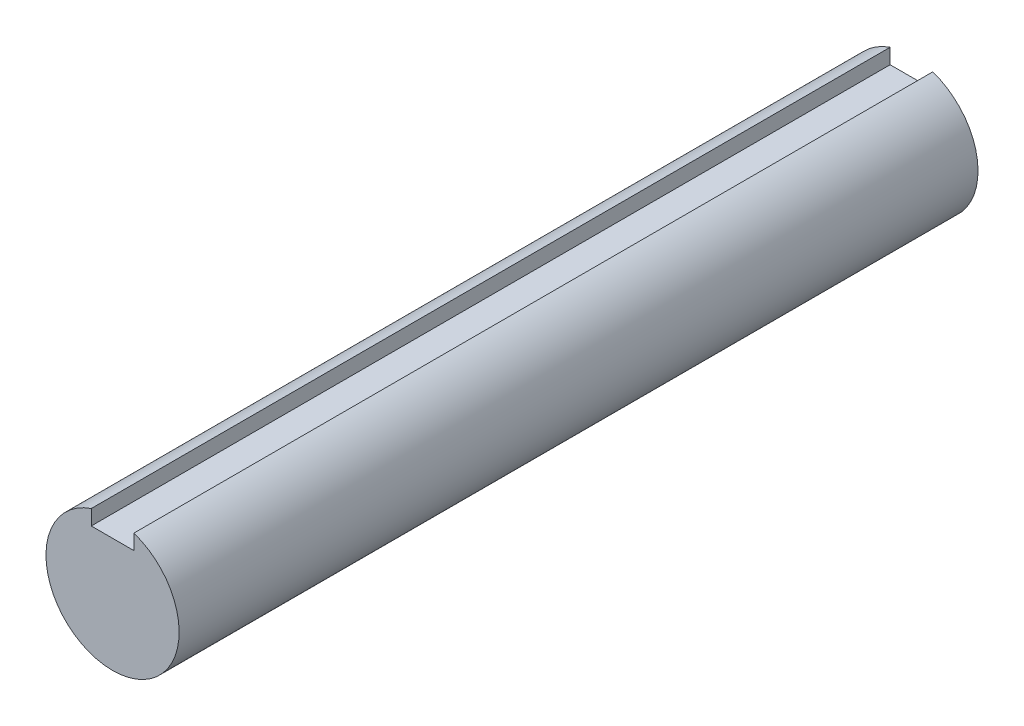
ISO-10303-21;
HEADER;
FILE_DESCRIPTION(('STEP AP214'),'2;1');
FILE_NAME('part.step','',(''),(''),'','','');
FILE_SCHEMA(('AUTOMOTIVE_DESIGN { 1 0 10303 214 1 1 1 1 }'));
ENDSEC;
DATA;
#1=APPLICATION_CONTEXT('core data for automotive mechanical design processes');
#2=APPLICATION_PROTOCOL_DEFINITION('international standard','automotive_design',2000,#1);
#3=PRODUCT_CONTEXT('',#1,'mechanical');
#4=PRODUCT('Part','Part','',(#3));
#5=PRODUCT_RELATED_PRODUCT_CATEGORY('part','',(#4));
#6=PRODUCT_DEFINITION_FORMATION('','',#4);
#7=PRODUCT_DEFINITION_CONTEXT('part definition',#1,'design');
#8=PRODUCT_DEFINITION('design','',#6,#7);
#9=PRODUCT_DEFINITION_SHAPE('','',#8);
#10=(LENGTH_UNIT() NAMED_UNIT(*) SI_UNIT(.MILLI.,.METRE.));
#11=(NAMED_UNIT(*) PLANE_ANGLE_UNIT() SI_UNIT($,.RADIAN.));
#12=(NAMED_UNIT(*) SI_UNIT($,.STERADIAN.) SOLID_ANGLE_UNIT());
#13=UNCERTAINTY_MEASURE_WITH_UNIT(LENGTH_MEASURE(1.E-05),#10,'distance_accuracy_value','');
#14=(GEOMETRIC_REPRESENTATION_CONTEXT(3) GLOBAL_UNCERTAINTY_ASSIGNED_CONTEXT((#13)) GLOBAL_UNIT_ASSIGNED_CONTEXT((#10,
#11,#12)) REPRESENTATION_CONTEXT('',''));
#15=CARTESIAN_POINT('',(0.,0.,0.));
#16=DIRECTION('',(0.,0.,1.));
#17=DIRECTION('',(1.,0.,0.));
#18=AXIS2_PLACEMENT_3D('',#15,#16,#17);
#19=CARTESIAN_POINT('',(-4.,0.,150.));
#20=DIRECTION('',(-1.,0.,0.));
#21=DIRECTION('',(0.,0.,1.));
#22=AXIS2_PLACEMENT_3D('',#19,#20,#21);
#23=PLANE('',#22);
#24=DIRECTION('',(0.,1.,0.));
#25=VECTOR('',#24,1.);
#26=CARTESIAN_POINT('',(-4.,0.,0.));
#27=LINE('',#26,#25);
#28=CARTESIAN_POINT('',(-4.,9.,0.));
#29=VERTEX_POINT('',#28);
#30=CARTESIAN_POINT('',(-4.,11.842719282327,0.));
#31=VERTEX_POINT('',#30);
#32=EDGE_CURVE('E107',#29,#31,#27,.T.);
#33=ORIENTED_EDGE('',*,*,#32,.T.);
#34=DIRECTION('',(0.,0.,-1.));
#35=VECTOR('',#34,1.);
#36=CARTESIAN_POINT('',(-4.,11.842719282327,150.));
#37=LINE('',#36,#35);
#38=CARTESIAN_POINT('',(-4.,11.842719282327,150.));
#39=VERTEX_POINT('',#38);
#40=EDGE_CURVE('E11',#39,#31,#37,.T.);
#41=ORIENTED_EDGE('',*,*,#40,.F.);
#42=DIRECTION('',(0.,1.,0.));
#43=VECTOR('',#42,1.);
#44=CARTESIAN_POINT('',(-4.,0.,150.));
#45=LINE('',#44,#43);
#46=CARTESIAN_POINT('',(-4.,9.,150.));
#47=VERTEX_POINT('',#46);
#48=EDGE_CURVE('E89',#47,#39,#45,.T.);
#49=ORIENTED_EDGE('',*,*,#48,.F.);
#50=DIRECTION('',(0.,0.,-1.));
#51=VECTOR('',#50,1.);
#52=CARTESIAN_POINT('',(-4.,9.,150.));
#53=LINE('',#52,#51);
#54=EDGE_CURVE('E56',#47,#29,#53,.T.);
#55=ORIENTED_EDGE('',*,*,#54,.T.);
#56=EDGE_LOOP('',(#33,#41,#49,#55));
#57=FACE_BOUND('',#56,.T.);
#58=ADVANCED_FACE('F39',(#57),#23,.F.);
#59=CARTESIAN_POINT('',(0.,0.,150.));
#60=DIRECTION('',(0.,0.,-1.));
#61=DIRECTION('',(-1.,0.,0.));
#62=AXIS2_PLACEMENT_3D('',#59,#60,#61);
#63=CYLINDRICAL_SURFACE('',#62,12.5);
#64=CARTESIAN_POINT('',(0.,0.,0.));
#65=DIRECTION('',(0.,0.,1.));
#66=DIRECTION('',(1.,0.,0.));
#67=AXIS2_PLACEMENT_3D('',#64,#65,#66);
#68=CIRCLE('',#67,12.5);
#69=CARTESIAN_POINT('',(4.,11.842719282327,0.));
#70=VERTEX_POINT('',#69);
#71=EDGE_CURVE('E95',#31,#70,#68,.T.);
#72=ORIENTED_EDGE('',*,*,#71,.T.);
#73=DIRECTION('',(0.,0.,-1.));
#74=VECTOR('',#73,1.);
#75=CARTESIAN_POINT('',(4.,11.842719282327,150.));
#76=LINE('',#75,#74);
#77=CARTESIAN_POINT('',(4.,11.842719282327,150.));
#78=VERTEX_POINT('',#77);
#79=EDGE_CURVE('E48',#78,#70,#76,.T.);
#80=ORIENTED_EDGE('',*,*,#79,.F.);
#81=CARTESIAN_POINT('',(0.,0.,150.));
#82=DIRECTION('',(0.,0.,1.));
#83=DIRECTION('',(1.,0.,0.));
#84=AXIS2_PLACEMENT_3D('',#81,#82,#83);
#85=CIRCLE('',#84,12.5);
#86=EDGE_CURVE('E81',#39,#78,#85,.T.);
#87=ORIENTED_EDGE('',*,*,#86,.F.);
#88=ORIENTED_EDGE('',*,*,#40,.T.);
#89=EDGE_LOOP('',(#72,#80,#87,#88));
#90=FACE_BOUND('',#89,.T.);
#91=ADVANCED_FACE('F94',(#90),#63,.T.);
#92=CARTESIAN_POINT('',(4.,0.,150.));
#93=DIRECTION('',(-1.,0.,0.));
#94=DIRECTION('',(0.,0.,1.));
#95=AXIS2_PLACEMENT_3D('',#92,#93,#94);
#96=PLANE('',#95);
#97=DIRECTION('',(0.,1.,0.));
#98=VECTOR('',#97,1.);
#99=CARTESIAN_POINT('',(4.,0.,0.));
#100=LINE('',#99,#98);
#101=CARTESIAN_POINT('',(4.,9.,0.));
#102=VERTEX_POINT('',#101);
#103=EDGE_CURVE('E112',#102,#70,#100,.T.);
#104=ORIENTED_EDGE('',*,*,#103,.F.);
#105=DIRECTION('',(0.,0.,-1.));
#106=VECTOR('',#105,1.);
#107=CARTESIAN_POINT('',(4.,9.,150.));
#108=LINE('',#107,#106);
#109=CARTESIAN_POINT('',(4.,9.,150.));
#110=VERTEX_POINT('',#109);
#111=EDGE_CURVE('E70',#110,#102,#108,.T.);
#112=ORIENTED_EDGE('',*,*,#111,.F.);
#113=DIRECTION('',(0.,1.,0.));
#114=VECTOR('',#113,1.);
#115=CARTESIAN_POINT('',(4.,0.,150.));
#116=LINE('',#115,#114);
#117=EDGE_CURVE('E88',#110,#78,#116,.T.);
#118=ORIENTED_EDGE('',*,*,#117,.T.);
#119=ORIENTED_EDGE('',*,*,#79,.T.);
#120=EDGE_LOOP('',(#104,#112,#118,#119));
#121=FACE_BOUND('',#120,.T.);
#122=ADVANCED_FACE('F99',(#121),#96,.T.);
#123=CARTESIAN_POINT('',(0.,9.,150.));
#124=DIRECTION('',(0.,1.,0.));
#125=DIRECTION('',(0.,0.,1.));
#126=AXIS2_PLACEMENT_3D('',#123,#124,#125);
#127=PLANE('',#126);
#128=DIRECTION('',(1.,0.,0.));
#129=VECTOR('',#128,1.);
#130=CARTESIAN_POINT('',(0.,9.,0.));
#131=LINE('',#130,#129);
#132=EDGE_CURVE('E115',#29,#102,#131,.T.);
#133=ORIENTED_EDGE('',*,*,#132,.F.);
#134=ORIENTED_EDGE('',*,*,#54,.F.);
#135=DIRECTION('',(1.,0.,0.));
#136=VECTOR('',#135,1.);
#137=CARTESIAN_POINT('',(0.,9.,150.));
#138=LINE('',#137,#136);
#139=EDGE_CURVE('E101',#47,#110,#138,.T.);
#140=ORIENTED_EDGE('',*,*,#139,.T.);
#141=ORIENTED_EDGE('',*,*,#111,.T.);
#142=EDGE_LOOP('',(#133,#134,#140,#141));
#143=FACE_BOUND('',#142,.T.);
#144=ADVANCED_FACE('F125',(#143),#127,.T.);
#145=CARTESIAN_POINT('',(0.,0.,150.));
#146=DIRECTION('',(0.,0.,1.));
#147=DIRECTION('',(1.,0.,0.));
#148=AXIS2_PLACEMENT_3D('',#145,#146,#147);
#149=PLANE('',#148);
#150=ORIENTED_EDGE('',*,*,#48,.T.);
#151=ORIENTED_EDGE('',*,*,#86,.T.);
#152=ORIENTED_EDGE('',*,*,#117,.F.);
#153=ORIENTED_EDGE('',*,*,#139,.F.);
#154=EDGE_LOOP('',(#150,#151,#152,#153));
#155=FACE_BOUND('',#154,.T.);
#156=ADVANCED_FACE('F85',(#155),#149,.T.);
#157=CARTESIAN_POINT('',(0.,0.,0.));
#158=DIRECTION('',(0.,0.,1.));
#159=DIRECTION('',(1.,0.,0.));
#160=AXIS2_PLACEMENT_3D('',#157,#158,#159);
#161=PLANE('',#160);
#162=ORIENTED_EDGE('',*,*,#32,.F.);
#163=ORIENTED_EDGE('',*,*,#132,.T.);
#164=ORIENTED_EDGE('',*,*,#103,.T.);
#165=ORIENTED_EDGE('',*,*,#71,.F.);
#166=EDGE_LOOP('',(#162,#163,#164,#165));
#167=FACE_BOUND('',#166,.T.);
#168=ADVANCED_FACE('F124',(#167),#161,.F.);
#169=CLOSED_SHELL('',(#58,#91,#122,#144,#156,#168));
#170=MANIFOLD_SOLID_BREP('B2',#169);
#171=ADVANCED_BREP_SHAPE_REPRESENTATION('',(#18,#170),#14);
#172=SHAPE_DEFINITION_REPRESENTATION(#9,#171);
ENDSEC;
END-ISO-10303-21;
